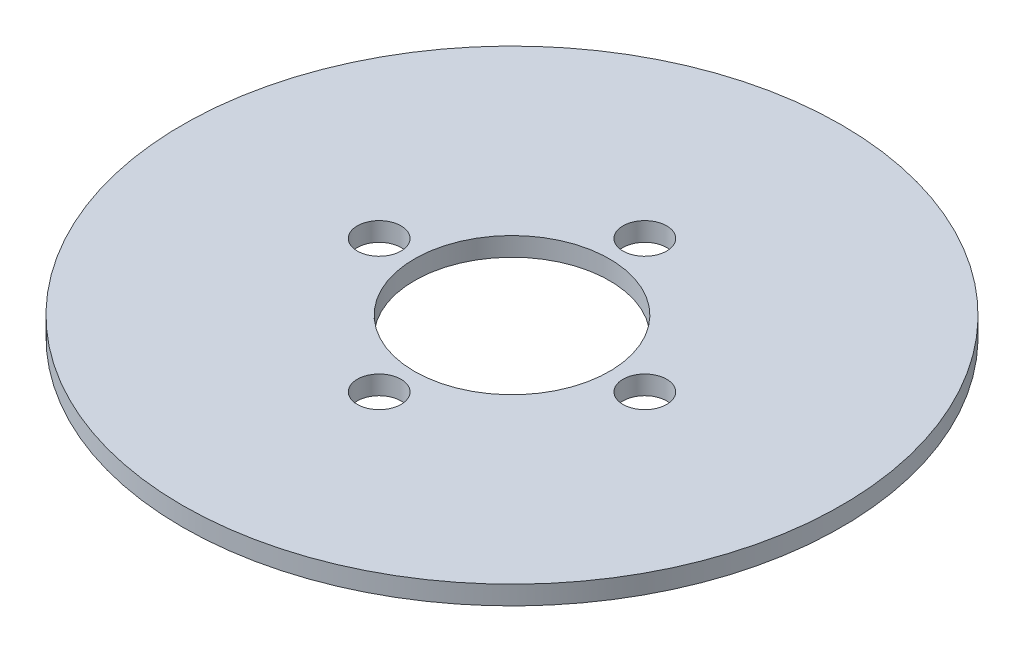
ISO-10303-21;
HEADER;
FILE_DESCRIPTION(('STEP AP214'),'2;1');
FILE_NAME('part.step','',(''),(''),'','','');
FILE_SCHEMA(('AUTOMOTIVE_DESIGN { 1 0 10303 214 1 1 1 1 }'));
ENDSEC;
DATA;
#1=APPLICATION_CONTEXT('core data for automotive mechanical design processes');
#2=APPLICATION_PROTOCOL_DEFINITION('international standard','automotive_design',2000,#1);
#3=PRODUCT_CONTEXT('',#1,'mechanical');
#4=PRODUCT('Part','Part','',(#3));
#5=PRODUCT_RELATED_PRODUCT_CATEGORY('part','',(#4));
#6=PRODUCT_DEFINITION_FORMATION('','',#4);
#7=PRODUCT_DEFINITION_CONTEXT('part definition',#1,'design');
#8=PRODUCT_DEFINITION('design','',#6,#7);
#9=PRODUCT_DEFINITION_SHAPE('','',#8);
#10=(LENGTH_UNIT() NAMED_UNIT(*) SI_UNIT(.MILLI.,.METRE.));
#11=(NAMED_UNIT(*) PLANE_ANGLE_UNIT() SI_UNIT($,.RADIAN.));
#12=(NAMED_UNIT(*) SI_UNIT($,.STERADIAN.) SOLID_ANGLE_UNIT());
#13=UNCERTAINTY_MEASURE_WITH_UNIT(LENGTH_MEASURE(1.E-05),#10,'distance_accuracy_value','');
#14=(GEOMETRIC_REPRESENTATION_CONTEXT(3) GLOBAL_UNCERTAINTY_ASSIGNED_CONTEXT((#13)) GLOBAL_UNIT_ASSIGNED_CONTEXT((#10,
#11,#12)) REPRESENTATION_CONTEXT('',''));
#15=CARTESIAN_POINT('',(0.,0.,0.));
#16=DIRECTION('',(0.,0.,1.));
#17=DIRECTION('',(1.,0.,0.));
#18=AXIS2_PLACEMENT_3D('',#15,#16,#17);
#19=CARTESIAN_POINT('',(0.,1.4,0.));
#20=DIRECTION('',(0.,1.,0.));
#21=DIRECTION('',(0.,0.,1.));
#22=AXIS2_PLACEMENT_3D('',#19,#20,#21);
#23=PLANE('',#22);
#24=CARTESIAN_POINT('',(0.,1.4,19.75));
#25=DIRECTION('',(0.,1.,0.));
#26=DIRECTION('',(0.,0.,1.));
#27=AXIS2_PLACEMENT_3D('',#24,#25,#26);
#28=CIRCLE('',#27,3.25);
#29=CARTESIAN_POINT('',(0.,1.4,23.));
#30=VERTEX_POINT('',#29);
#31=EDGE_CURVE('E65',#30,#30,#28,.T.);
#32=ORIENTED_EDGE('',*,*,#31,.F.);
#33=EDGE_LOOP('',(#32));
#34=FACE_BOUND('',#33,.T.);
#35=CARTESIAN_POINT('',(0.,1.4,-19.75));
#36=DIRECTION('',(0.,1.,0.));
#37=DIRECTION('',(0.,0.,1.));
#38=AXIS2_PLACEMENT_3D('',#35,#36,#37);
#39=CIRCLE('',#38,3.25);
#40=CARTESIAN_POINT('',(0.,1.4,-16.5));
#41=VERTEX_POINT('',#40);
#42=EDGE_CURVE('E53',#41,#41,#39,.T.);
#43=ORIENTED_EDGE('',*,*,#42,.F.);
#44=EDGE_LOOP('',(#43));
#45=FACE_BOUND('',#44,.T.);
#46=CARTESIAN_POINT('',(0.,1.4,0.));
#47=DIRECTION('',(0.,1.,0.));
#48=DIRECTION('',(0.,0.,1.));
#49=AXIS2_PLACEMENT_3D('',#46,#47,#48);
#50=CIRCLE('',#49,49.);
#51=CARTESIAN_POINT('',(0.,1.4,49.));
#52=VERTEX_POINT('',#51);
#53=EDGE_CURVE('E10',#52,#52,#50,.T.);
#54=ORIENTED_EDGE('',*,*,#53,.T.);
#55=EDGE_LOOP('',(#54));
#56=FACE_BOUND('',#55,.T.);
#57=CARTESIAN_POINT('',(0.,1.4,0.));
#58=DIRECTION('',(0.,1.,0.));
#59=DIRECTION('',(0.,0.,1.));
#60=AXIS2_PLACEMENT_3D('',#57,#58,#59);
#61=CIRCLE('',#60,14.5);
#62=CARTESIAN_POINT('',(0.,1.4,14.5));
#63=VERTEX_POINT('',#62);
#64=EDGE_CURVE('E48',#63,#63,#61,.T.);
#65=ORIENTED_EDGE('',*,*,#64,.F.);
#66=EDGE_LOOP('',(#65));
#67=FACE_BOUND('',#66,.T.);
#68=CARTESIAN_POINT('',(19.75,1.4,0.));
#69=DIRECTION('',(0.,1.,0.));
#70=DIRECTION('',(0.,0.,1.));
#71=AXIS2_PLACEMENT_3D('',#68,#69,#70);
#72=CIRCLE('',#71,3.25);
#73=CARTESIAN_POINT('',(19.75,1.4,3.25));
#74=VERTEX_POINT('',#73);
#75=EDGE_CURVE('E59',#74,#74,#72,.T.);
#76=ORIENTED_EDGE('',*,*,#75,.F.);
#77=EDGE_LOOP('',(#76));
#78=FACE_BOUND('',#77,.T.);
#79=CARTESIAN_POINT('',(-19.75,1.4,0.));
#80=DIRECTION('',(0.,1.,0.));
#81=DIRECTION('',(0.,0.,1.));
#82=AXIS2_PLACEMENT_3D('',#79,#80,#81);
#83=CIRCLE('',#82,3.25);
#84=CARTESIAN_POINT('',(-19.75,1.4,3.25));
#85=VERTEX_POINT('',#84);
#86=EDGE_CURVE('E71',#85,#85,#83,.T.);
#87=ORIENTED_EDGE('',*,*,#86,.F.);
#88=EDGE_LOOP('',(#87));
#89=FACE_BOUND('',#88,.T.);
#90=ADVANCED_FACE('F37',(#34,#45,#56,#67,#78,#89),#23,.T.);
#91=CARTESIAN_POINT('',(0.,-1.4,0.));
#92=DIRECTION('',(0.,1.,0.));
#93=DIRECTION('',(0.,0.,1.));
#94=AXIS2_PLACEMENT_3D('',#91,#92,#93);
#95=PLANE('',#94);
#96=CARTESIAN_POINT('',(0.,-1.4,0.));
#97=DIRECTION('',(0.,1.,0.));
#98=DIRECTION('',(0.,0.,1.));
#99=AXIS2_PLACEMENT_3D('',#96,#97,#98);
#100=CIRCLE('',#99,49.);
#101=CARTESIAN_POINT('',(0.,-1.4,49.));
#102=VERTEX_POINT('',#101);
#103=EDGE_CURVE('E41',#102,#102,#100,.T.);
#104=ORIENTED_EDGE('',*,*,#103,.F.);
#105=EDGE_LOOP('',(#104));
#106=FACE_BOUND('',#105,.T.);
#107=CARTESIAN_POINT('',(0.,-1.4,0.));
#108=DIRECTION('',(0.,1.,0.));
#109=DIRECTION('',(0.,0.,1.));
#110=AXIS2_PLACEMENT_3D('',#107,#108,#109);
#111=CIRCLE('',#110,14.5);
#112=CARTESIAN_POINT('',(0.,-1.4,14.5));
#113=VERTEX_POINT('',#112);
#114=EDGE_CURVE('E50',#113,#113,#111,.T.);
#115=ORIENTED_EDGE('',*,*,#114,.T.);
#116=EDGE_LOOP('',(#115));
#117=FACE_BOUND('',#116,.T.);
#118=CARTESIAN_POINT('',(0.,-1.4,-19.75));
#119=DIRECTION('',(0.,1.,0.));
#120=DIRECTION('',(0.,0.,1.));
#121=AXIS2_PLACEMENT_3D('',#118,#119,#120);
#122=CIRCLE('',#121,3.25);
#123=CARTESIAN_POINT('',(0.,-1.4,-16.5));
#124=VERTEX_POINT('',#123);
#125=EDGE_CURVE('E56',#124,#124,#122,.T.);
#126=ORIENTED_EDGE('',*,*,#125,.T.);
#127=EDGE_LOOP('',(#126));
#128=FACE_BOUND('',#127,.T.);
#129=CARTESIAN_POINT('',(19.75,-1.4,0.));
#130=DIRECTION('',(0.,1.,0.));
#131=DIRECTION('',(0.,0.,1.));
#132=AXIS2_PLACEMENT_3D('',#129,#130,#131);
#133=CIRCLE('',#132,3.25);
#134=CARTESIAN_POINT('',(19.75,-1.4,3.25));
#135=VERTEX_POINT('',#134);
#136=EDGE_CURVE('E62',#135,#135,#133,.T.);
#137=ORIENTED_EDGE('',*,*,#136,.T.);
#138=EDGE_LOOP('',(#137));
#139=FACE_BOUND('',#138,.T.);
#140=CARTESIAN_POINT('',(0.,-1.4,19.75));
#141=DIRECTION('',(0.,1.,0.));
#142=DIRECTION('',(0.,0.,1.));
#143=AXIS2_PLACEMENT_3D('',#140,#141,#142);
#144=CIRCLE('',#143,3.25);
#145=CARTESIAN_POINT('',(0.,-1.4,23.));
#146=VERTEX_POINT('',#145);
#147=EDGE_CURVE('E68',#146,#146,#144,.T.);
#148=ORIENTED_EDGE('',*,*,#147,.T.);
#149=EDGE_LOOP('',(#148));
#150=FACE_BOUND('',#149,.T.);
#151=CARTESIAN_POINT('',(-19.75,-1.4,0.));
#152=DIRECTION('',(0.,1.,0.));
#153=DIRECTION('',(0.,0.,1.));
#154=AXIS2_PLACEMENT_3D('',#151,#152,#153);
#155=CIRCLE('',#154,3.25);
#156=CARTESIAN_POINT('',(-19.75,-1.4,3.25));
#157=VERTEX_POINT('',#156);
#158=EDGE_CURVE('E74',#157,#157,#155,.T.);
#159=ORIENTED_EDGE('',*,*,#158,.T.);
#160=EDGE_LOOP('',(#159));
#161=FACE_BOUND('',#160,.T.);
#162=ADVANCED_FACE('F84',(#106,#117,#128,#139,#150,#161),#95,.F.);
#163=CARTESIAN_POINT('',(0.,1.4,0.));
#164=DIRECTION('',(0.,-1.,0.));
#165=DIRECTION('',(0.,0.,-1.));
#166=AXIS2_PLACEMENT_3D('',#163,#164,#165);
#167=CYLINDRICAL_SURFACE('',#166,49.);
#168=ORIENTED_EDGE('',*,*,#53,.F.);
#169=EDGE_LOOP('',(#168));
#170=FACE_BOUND('',#169,.T.);
#171=ORIENTED_EDGE('',*,*,#103,.T.);
#172=EDGE_LOOP('',(#171));
#173=FACE_BOUND('',#172,.T.);
#174=ADVANCED_FACE('F39',(#170,#173),#167,.T.);
#175=CARTESIAN_POINT('',(0.,1.4,0.));
#176=DIRECTION('',(0.,-1.,0.));
#177=DIRECTION('',(0.,0.,-1.));
#178=AXIS2_PLACEMENT_3D('',#175,#176,#177);
#179=CYLINDRICAL_SURFACE('',#178,14.5);
#180=ORIENTED_EDGE('',*,*,#64,.T.);
#181=EDGE_LOOP('',(#180));
#182=FACE_BOUND('',#181,.T.);
#183=ORIENTED_EDGE('',*,*,#114,.F.);
#184=EDGE_LOOP('',(#183));
#185=FACE_BOUND('',#184,.T.);
#186=ADVANCED_FACE('F94',(#182,#185),#179,.F.);
#187=CARTESIAN_POINT('',(0.,1.4,-19.75));
#188=DIRECTION('',(0.,-1.,0.));
#189=DIRECTION('',(0.,0.,-1.));
#190=AXIS2_PLACEMENT_3D('',#187,#188,#189);
#191=CYLINDRICAL_SURFACE('',#190,3.25);
#192=ORIENTED_EDGE('',*,*,#42,.T.);
#193=EDGE_LOOP('',(#192));
#194=FACE_BOUND('',#193,.T.);
#195=ORIENTED_EDGE('',*,*,#125,.F.);
#196=EDGE_LOOP('',(#195));
#197=FACE_BOUND('',#196,.T.);
#198=ADVANCED_FACE('F97',(#194,#197),#191,.F.);
#199=CARTESIAN_POINT('',(19.75,1.4,0.));
#200=DIRECTION('',(0.,-1.,0.));
#201=DIRECTION('',(0.,0.,-1.));
#202=AXIS2_PLACEMENT_3D('',#199,#200,#201);
#203=CYLINDRICAL_SURFACE('',#202,3.25);
#204=ORIENTED_EDGE('',*,*,#75,.T.);
#205=EDGE_LOOP('',(#204));
#206=FACE_BOUND('',#205,.T.);
#207=ORIENTED_EDGE('',*,*,#136,.F.);
#208=EDGE_LOOP('',(#207));
#209=FACE_BOUND('',#208,.T.);
#210=ADVANCED_FACE('F101',(#206,#209),#203,.F.);
#211=CARTESIAN_POINT('',(0.,1.4,19.75));
#212=DIRECTION('',(0.,-1.,0.));
#213=DIRECTION('',(0.,0.,-1.));
#214=AXIS2_PLACEMENT_3D('',#211,#212,#213);
#215=CYLINDRICAL_SURFACE('',#214,3.25);
#216=ORIENTED_EDGE('',*,*,#31,.T.);
#217=EDGE_LOOP('',(#216));
#218=FACE_BOUND('',#217,.T.);
#219=ORIENTED_EDGE('',*,*,#147,.F.);
#220=EDGE_LOOP('',(#219));
#221=FACE_BOUND('',#220,.T.);
#222=ADVANCED_FACE('F105',(#218,#221),#215,.F.);
#223=CARTESIAN_POINT('',(-19.75,1.4,0.));
#224=DIRECTION('',(0.,-1.,0.));
#225=DIRECTION('',(0.,0.,-1.));
#226=AXIS2_PLACEMENT_3D('',#223,#224,#225);
#227=CYLINDRICAL_SURFACE('',#226,3.25);
#228=ORIENTED_EDGE('',*,*,#86,.T.);
#229=EDGE_LOOP('',(#228));
#230=FACE_BOUND('',#229,.T.);
#231=ORIENTED_EDGE('',*,*,#158,.F.);
#232=EDGE_LOOP('',(#231));
#233=FACE_BOUND('',#232,.T.);
#234=ADVANCED_FACE('F80',(#230,#233),#227,.F.);
#235=CLOSED_SHELL('',(#90,#162,#174,#186,#198,#210,#222,#234));
#236=MANIFOLD_SOLID_BREP('B2',#235);
#237=ADVANCED_BREP_SHAPE_REPRESENTATION('',(#18,#236),#14);
#238=SHAPE_DEFINITION_REPRESENTATION(#9,#237);
ENDSEC;
END-ISO-10303-21;
